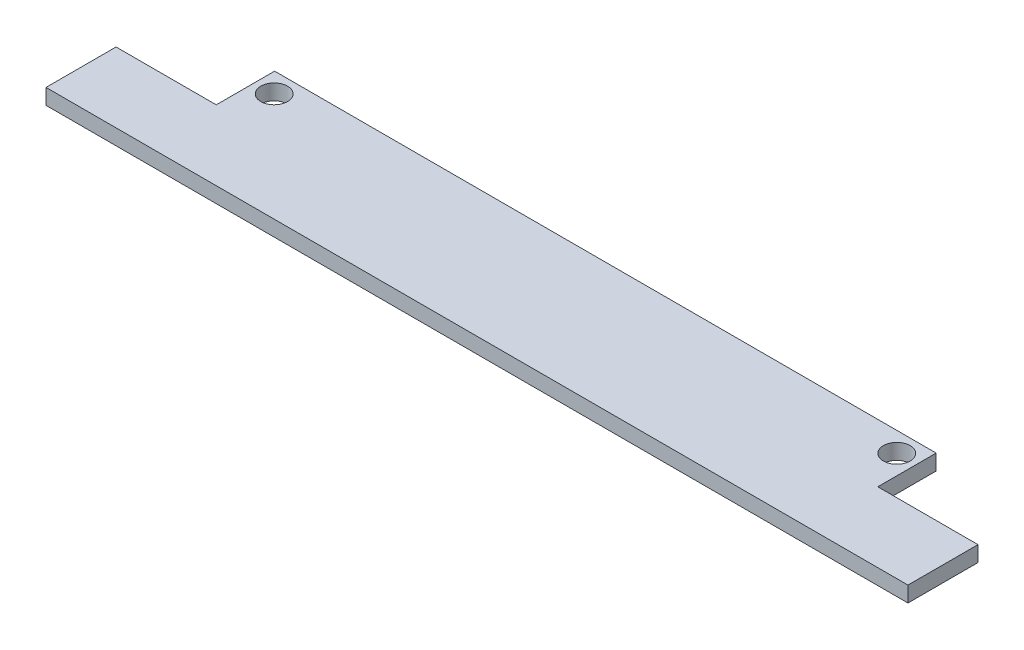
ISO-10303-21;
HEADER;
FILE_DESCRIPTION(('STEP AP214'),'2;1');
FILE_NAME('part.step','',(''),(''),'','','');
FILE_SCHEMA(('AUTOMOTIVE_DESIGN { 1 0 10303 214 1 1 1 1 }'));
ENDSEC;
DATA;
#1=APPLICATION_CONTEXT('core data for automotive mechanical design processes');
#2=APPLICATION_PROTOCOL_DEFINITION('international standard','automotive_design',2000,#1);
#3=PRODUCT_CONTEXT('',#1,'mechanical');
#4=PRODUCT('Part','Part','',(#3));
#5=PRODUCT_RELATED_PRODUCT_CATEGORY('part','',(#4));
#6=PRODUCT_DEFINITION_FORMATION('','',#4);
#7=PRODUCT_DEFINITION_CONTEXT('part definition',#1,'design');
#8=PRODUCT_DEFINITION('design','',#6,#7);
#9=PRODUCT_DEFINITION_SHAPE('','',#8);
#10=(LENGTH_UNIT() NAMED_UNIT(*) SI_UNIT(.MILLI.,.METRE.));
#11=(NAMED_UNIT(*) PLANE_ANGLE_UNIT() SI_UNIT($,.RADIAN.));
#12=(NAMED_UNIT(*) SI_UNIT($,.STERADIAN.) SOLID_ANGLE_UNIT());
#13=UNCERTAINTY_MEASURE_WITH_UNIT(LENGTH_MEASURE(1.E-05),#10,'distance_accuracy_value','');
#14=(GEOMETRIC_REPRESENTATION_CONTEXT(3) GLOBAL_UNCERTAINTY_ASSIGNED_CONTEXT((#13)) GLOBAL_UNIT_ASSIGNED_CONTEXT((#10,
#11,#12)) REPRESENTATION_CONTEXT('',''));
#15=CARTESIAN_POINT('',(0.,0.,0.));
#16=DIRECTION('',(0.,0.,1.));
#17=DIRECTION('',(1.,0.,0.));
#18=AXIS2_PLACEMENT_3D('',#15,#16,#17);
#19=CARTESIAN_POINT('',(53.6050386934042,1.6,1.03322132280104E-13));
#20=DIRECTION('',(1.,0.,0.));
#21=DIRECTION('',(0.,0.,-1.));
#22=AXIS2_PLACEMENT_3D('',#19,#20,#21);
#23=PLANE('',#22);
#24=DIRECTION('',(0.,0.,1.));
#25=VECTOR('',#24,1.);
#26=CARTESIAN_POINT('',(53.6050386934042,0.,1.03322132280104E-13));
#27=LINE('',#26,#25);
#28=CARTESIAN_POINT('',(53.6050386934042,0.,25.3150601226482));
#29=VERTEX_POINT('',#28);
#30=CARTESIAN_POINT('',(53.6050386934042,0.,32.5150601226483));
#31=VERTEX_POINT('',#30);
#32=EDGE_CURVE('E173',#29,#31,#27,.T.);
#33=ORIENTED_EDGE('',*,*,#32,.F.);
#34=DIRECTION('',(0.,-1.,0.));
#35=VECTOR('',#34,1.);
#36=CARTESIAN_POINT('',(53.6050386934042,1.6,25.3150601226482));
#37=LINE('',#36,#35);
#38=CARTESIAN_POINT('',(53.6050386934042,1.6,25.3150601226482));
#39=VERTEX_POINT('',#38);
#40=EDGE_CURVE('E11',#39,#29,#37,.T.);
#41=ORIENTED_EDGE('',*,*,#40,.F.);
#42=DIRECTION('',(0.,0.,1.));
#43=VECTOR('',#42,1.);
#44=CARTESIAN_POINT('',(53.6050386934042,1.6,1.03322132280104E-13));
#45=LINE('',#44,#43);
#46=CARTESIAN_POINT('',(53.6050386934042,1.6,32.5150601226483));
#47=VERTEX_POINT('',#46);
#48=EDGE_CURVE('E132',#39,#47,#45,.T.);
#49=ORIENTED_EDGE('',*,*,#48,.T.);
#50=DIRECTION('',(0.,-1.,0.));
#51=VECTOR('',#50,1.);
#52=CARTESIAN_POINT('',(53.6050386934042,1.6,32.5150601226483));
#53=LINE('',#52,#51);
#54=EDGE_CURVE('E85',#47,#31,#53,.T.);
#55=ORIENTED_EDGE('',*,*,#54,.T.);
#56=EDGE_LOOP('',(#33,#41,#49,#55));
#57=FACE_BOUND('',#56,.T.);
#58=ADVANCED_FACE('F35',(#57),#23,.T.);
#59=CARTESIAN_POINT('',(0.,1.6,25.3150601226483));
#60=DIRECTION('',(0.,0.,-1.));
#61=DIRECTION('',(-1.,0.,0.));
#62=AXIS2_PLACEMENT_3D('',#59,#60,#61);
#63=PLANE('',#62);
#64=DIRECTION('',(1.,0.,0.));
#65=VECTOR('',#64,1.);
#66=CARTESIAN_POINT('',(0.,0.,25.3150601226483));
#67=LINE('',#66,#65);
#68=CARTESIAN_POINT('',(43.3050386934042,0.,25.3150601226483));
#69=VERTEX_POINT('',#68);
#70=EDGE_CURVE('E167',#69,#29,#67,.T.);
#71=ORIENTED_EDGE('',*,*,#70,.F.);
#72=DIRECTION('',(0.,-1.,0.));
#73=VECTOR('',#72,1.);
#74=CARTESIAN_POINT('',(43.3050386934042,1.6,25.3150601226483));
#75=LINE('',#74,#73);
#76=CARTESIAN_POINT('',(43.3050386934042,1.6,25.3150601226483));
#77=VERTEX_POINT('',#76);
#78=EDGE_CURVE('E43',#77,#69,#75,.T.);
#79=ORIENTED_EDGE('',*,*,#78,.F.);
#80=DIRECTION('',(1.,0.,0.));
#81=VECTOR('',#80,1.);
#82=CARTESIAN_POINT('',(0.,1.6,25.3150601226483));
#83=LINE('',#82,#81);
#84=EDGE_CURVE('E125',#77,#39,#83,.T.);
#85=ORIENTED_EDGE('',*,*,#84,.T.);
#86=ORIENTED_EDGE('',*,*,#40,.T.);
#87=EDGE_LOOP('',(#71,#79,#85,#86));
#88=FACE_BOUND('',#87,.T.);
#89=ADVANCED_FACE('F172',(#88),#63,.T.);
#90=CARTESIAN_POINT('',(43.3050386934042,1.6,0.));
#91=DIRECTION('',(-1.,0.,0.));
#92=DIRECTION('',(0.,0.,1.));
#93=AXIS2_PLACEMENT_3D('',#90,#91,#92);
#94=PLANE('',#93);
#95=DIRECTION('',(0.,0.,-1.));
#96=VECTOR('',#95,1.);
#97=CARTESIAN_POINT('',(43.3050386934042,0.,0.));
#98=LINE('',#97,#96);
#99=CARTESIAN_POINT('',(43.3050386934042,0.,19.3150601226483));
#100=VERTEX_POINT('',#99);
#101=EDGE_CURVE('E159',#69,#100,#98,.T.);
#102=ORIENTED_EDGE('',*,*,#101,.T.);
#103=DIRECTION('',(0.,-1.,0.));
#104=VECTOR('',#103,1.);
#105=CARTESIAN_POINT('',(43.3050386934042,1.6,19.3150601226483));
#106=LINE('',#105,#104);
#107=CARTESIAN_POINT('',(43.3050386934042,1.6,19.3150601226483));
#108=VERTEX_POINT('',#107);
#109=EDGE_CURVE('E152',#108,#100,#106,.T.);
#110=ORIENTED_EDGE('',*,*,#109,.F.);
#111=DIRECTION('',(0.,0.,-1.));
#112=VECTOR('',#111,1.);
#113=CARTESIAN_POINT('',(43.3050386934042,1.6,0.));
#114=LINE('',#113,#112);
#115=EDGE_CURVE('E131',#77,#108,#114,.T.);
#116=ORIENTED_EDGE('',*,*,#115,.F.);
#117=ORIENTED_EDGE('',*,*,#78,.T.);
#118=EDGE_LOOP('',(#102,#110,#116,#117));
#119=FACE_BOUND('',#118,.T.);
#120=ADVANCED_FACE('F157',(#119),#94,.F.);
#121=CARTESIAN_POINT('',(0.,1.6,19.3150601226483));
#122=DIRECTION('',(0.,0.,-1.));
#123=DIRECTION('',(-1.,0.,0.));
#124=AXIS2_PLACEMENT_3D('',#121,#122,#123);
#125=PLANE('',#124);
#126=DIRECTION('',(1.,0.,0.));
#127=VECTOR('',#126,1.);
#128=CARTESIAN_POINT('',(0.,0.,19.3150601226483));
#129=LINE('',#128,#127);
#130=CARTESIAN_POINT('',(-24.6949613065958,0.,19.3150601226483));
#131=VERTEX_POINT('',#130);
#132=EDGE_CURVE('E170',#131,#100,#129,.T.);
#133=ORIENTED_EDGE('',*,*,#132,.F.);
#134=DIRECTION('',(0.,-1.,0.));
#135=VECTOR('',#134,1.);
#136=CARTESIAN_POINT('',(-24.6949613065958,1.6,19.3150601226483));
#137=LINE('',#136,#135);
#138=CARTESIAN_POINT('',(-24.6949613065958,1.6,19.3150601226483));
#139=VERTEX_POINT('',#138);
#140=EDGE_CURVE('E150',#139,#131,#137,.T.);
#141=ORIENTED_EDGE('',*,*,#140,.F.);
#142=DIRECTION('',(1.,0.,0.));
#143=VECTOR('',#142,1.);
#144=CARTESIAN_POINT('',(0.,1.6,19.3150601226483));
#145=LINE('',#144,#143);
#146=EDGE_CURVE('E126',#139,#108,#145,.T.);
#147=ORIENTED_EDGE('',*,*,#146,.T.);
#148=ORIENTED_EDGE('',*,*,#109,.T.);
#149=EDGE_LOOP('',(#133,#141,#147,#148));
#150=FACE_BOUND('',#149,.T.);
#151=ADVANCED_FACE('F192',(#150),#125,.T.);
#152=CARTESIAN_POINT('',(-24.6949613065958,1.6,0.));
#153=DIRECTION('',(-1.,0.,0.));
#154=DIRECTION('',(0.,0.,1.));
#155=AXIS2_PLACEMENT_3D('',#152,#153,#154);
#156=PLANE('',#155);
#157=DIRECTION('',(0.,0.,-1.));
#158=VECTOR('',#157,1.);
#159=CARTESIAN_POINT('',(-24.6949613065958,0.,0.));
#160=LINE('',#159,#158);
#161=CARTESIAN_POINT('',(-24.6949613065958,0.,25.3150601226483));
#162=VERTEX_POINT('',#161);
#163=EDGE_CURVE('E176',#162,#131,#160,.T.);
#164=ORIENTED_EDGE('',*,*,#163,.F.);
#165=DIRECTION('',(0.,-1.,0.));
#166=VECTOR('',#165,1.);
#167=CARTESIAN_POINT('',(-24.6949613065958,1.6,25.3150601226483));
#168=LINE('',#167,#166);
#169=CARTESIAN_POINT('',(-24.6949613065958,1.6,25.3150601226483));
#170=VERTEX_POINT('',#169);
#171=EDGE_CURVE('E112',#170,#162,#168,.T.);
#172=ORIENTED_EDGE('',*,*,#171,.F.);
#173=DIRECTION('',(0.,0.,-1.));
#174=VECTOR('',#173,1.);
#175=CARTESIAN_POINT('',(-24.6949613065958,1.6,0.));
#176=LINE('',#175,#174);
#177=EDGE_CURVE('E123',#170,#139,#176,.T.);
#178=ORIENTED_EDGE('',*,*,#177,.T.);
#179=ORIENTED_EDGE('',*,*,#140,.T.);
#180=EDGE_LOOP('',(#164,#172,#178,#179));
#181=FACE_BOUND('',#180,.T.);
#182=ADVANCED_FACE('F196',(#181),#156,.T.);
#183=CARTESIAN_POINT('',(-34.9949613065958,0.,25.3150601226483));
#184=VERTEX_POINT('',#183);
#185=EDGE_CURVE('E111',#184,#162,#67,.T.);
#186=ORIENTED_EDGE('',*,*,#185,.F.);
#187=DIRECTION('',(0.,-1.,0.));
#188=VECTOR('',#187,1.);
#189=CARTESIAN_POINT('',(-34.9949613065958,1.6,25.3150601226483));
#190=LINE('',#189,#188);
#191=CARTESIAN_POINT('',(-34.9949613065958,1.6,25.3150601226483));
#192=VERTEX_POINT('',#191);
#193=EDGE_CURVE('E105',#192,#184,#190,.T.);
#194=ORIENTED_EDGE('',*,*,#193,.F.);
#195=EDGE_CURVE('E109',#192,#170,#83,.T.);
#196=ORIENTED_EDGE('',*,*,#195,.T.);
#197=ORIENTED_EDGE('',*,*,#171,.T.);
#198=EDGE_LOOP('',(#186,#194,#196,#197));
#199=FACE_BOUND('',#198,.T.);
#200=ADVANCED_FACE('F107',(#199),#63,.T.);
#201=CARTESIAN_POINT('',(-34.9949613065959,1.6,0.));
#202=DIRECTION('',(1.,0.,0.));
#203=DIRECTION('',(0.,0.,-1.));
#204=AXIS2_PLACEMENT_3D('',#201,#202,#203);
#205=PLANE('',#204);
#206=DIRECTION('',(0.,0.,1.));
#207=VECTOR('',#206,1.);
#208=CARTESIAN_POINT('',(-34.9949613065959,0.,0.));
#209=LINE('',#208,#207);
#210=CARTESIAN_POINT('',(-34.9949613065958,0.,32.5150601226483));
#211=VERTEX_POINT('',#210);
#212=EDGE_CURVE('E78',#184,#211,#209,.T.);
#213=ORIENTED_EDGE('',*,*,#212,.T.);
#214=DIRECTION('',(0.,-1.,0.));
#215=VECTOR('',#214,1.);
#216=CARTESIAN_POINT('',(-34.9949613065958,1.6,32.5150601226483));
#217=LINE('',#216,#215);
#218=CARTESIAN_POINT('',(-34.9949613065958,1.6,32.5150601226483));
#219=VERTEX_POINT('',#218);
#220=EDGE_CURVE('E113',#219,#211,#217,.T.);
#221=ORIENTED_EDGE('',*,*,#220,.F.);
#222=DIRECTION('',(0.,0.,1.));
#223=VECTOR('',#222,1.);
#224=CARTESIAN_POINT('',(-34.9949613065959,1.6,0.));
#225=LINE('',#224,#223);
#226=EDGE_CURVE('E115',#192,#219,#225,.T.);
#227=ORIENTED_EDGE('',*,*,#226,.F.);
#228=ORIENTED_EDGE('',*,*,#193,.T.);
#229=EDGE_LOOP('',(#213,#221,#227,#228));
#230=FACE_BOUND('',#229,.T.);
#231=ADVANCED_FACE('F116',(#230),#205,.F.);
#232=CARTESIAN_POINT('',(-22.6949613065958,1.6,21.3622913657332));
#233=DIRECTION('',(0.,-1.,0.));
#234=DIRECTION('',(0.,0.,-1.));
#235=AXIS2_PLACEMENT_3D('',#232,#233,#234);
#236=CYLINDRICAL_SURFACE('',#235,1.375);
#237=CARTESIAN_POINT('',(-22.6949613065958,1.6,21.3622913657332));
#238=DIRECTION('',(0.,1.,0.));
#239=DIRECTION('',(0.,0.,1.));
#240=AXIS2_PLACEMENT_3D('',#237,#238,#239);
#241=CIRCLE('',#240,1.375);
#242=CARTESIAN_POINT('',(-22.6949613065958,1.6,22.7372913657332));
#243=VERTEX_POINT('',#242);
#244=EDGE_CURVE('E212',#243,#243,#241,.T.);
#245=ORIENTED_EDGE('',*,*,#244,.T.);
#246=EDGE_LOOP('',(#245));
#247=FACE_BOUND('',#246,.T.);
#248=CARTESIAN_POINT('',(-22.6949613065958,0.,21.3622913657332));
#249=DIRECTION('',(0.,1.,0.));
#250=DIRECTION('',(0.,0.,1.));
#251=AXIS2_PLACEMENT_3D('',#248,#249,#250);
#252=CIRCLE('',#251,1.375);
#253=CARTESIAN_POINT('',(-22.6949613065958,0.,22.7372913657332));
#254=VERTEX_POINT('',#253);
#255=EDGE_CURVE('E137',#254,#254,#252,.T.);
#256=ORIENTED_EDGE('',*,*,#255,.F.);
#257=EDGE_LOOP('',(#256));
#258=FACE_BOUND('',#257,.T.);
#259=ADVANCED_FACE('F201',(#247,#258),#236,.F.);
#260=CARTESIAN_POINT('',(0.,1.6,32.5150601226483));
#261=DIRECTION('',(0.,0.,-1.));
#262=DIRECTION('',(-1.,0.,0.));
#263=AXIS2_PLACEMENT_3D('',#260,#261,#262);
#264=PLANE('',#263);
#265=DIRECTION('',(1.,0.,0.));
#266=VECTOR('',#265,1.);
#267=CARTESIAN_POINT('',(0.,0.,32.5150601226483));
#268=LINE('',#267,#266);
#269=EDGE_CURVE('E142',#211,#31,#268,.T.);
#270=ORIENTED_EDGE('',*,*,#269,.T.);
#271=ORIENTED_EDGE('',*,*,#54,.F.);
#272=DIRECTION('',(1.,0.,0.));
#273=VECTOR('',#272,1.);
#274=CARTESIAN_POINT('',(0.,1.6,32.5150601226483));
#275=LINE('',#274,#273);
#276=EDGE_CURVE('E51',#219,#47,#275,.T.);
#277=ORIENTED_EDGE('',*,*,#276,.F.);
#278=ORIENTED_EDGE('',*,*,#220,.T.);
#279=EDGE_LOOP('',(#270,#271,#277,#278));
#280=FACE_BOUND('',#279,.T.);
#281=ADVANCED_FACE('F183',(#280),#264,.F.);
#282=CARTESIAN_POINT('',(41.3050386934042,1.6,21.3622913657332));
#283=DIRECTION('',(0.,-1.,0.));
#284=DIRECTION('',(0.,0.,-1.));
#285=AXIS2_PLACEMENT_3D('',#282,#283,#284);
#286=CYLINDRICAL_SURFACE('',#285,1.375);
#287=CARTESIAN_POINT('',(41.3050386934042,1.6,21.3622913657332));
#288=DIRECTION('',(0.,1.,0.));
#289=DIRECTION('',(0.,0.,1.));
#290=AXIS2_PLACEMENT_3D('',#287,#288,#289);
#291=CIRCLE('',#290,1.375);
#292=CARTESIAN_POINT('',(41.3050386934042,1.6,22.7372913657332));
#293=VERTEX_POINT('',#292);
#294=EDGE_CURVE('E147',#293,#293,#291,.F.);
#295=ORIENTED_EDGE('',*,*,#294,.F.);
#296=EDGE_LOOP('',(#295));
#297=FACE_BOUND('',#296,.T.);
#298=CARTESIAN_POINT('',(41.3050386934042,0.,21.3622913657332));
#299=DIRECTION('',(0.,1.,0.));
#300=DIRECTION('',(0.,0.,1.));
#301=AXIS2_PLACEMENT_3D('',#298,#299,#300);
#302=CIRCLE('',#301,1.375);
#303=CARTESIAN_POINT('',(41.3050386934042,0.,22.7372913657332));
#304=VERTEX_POINT('',#303);
#305=EDGE_CURVE('E135',#304,#304,#302,.F.);
#306=ORIENTED_EDGE('',*,*,#305,.T.);
#307=EDGE_LOOP('',(#306));
#308=FACE_BOUND('',#307,.T.);
#309=ADVANCED_FACE('F219',(#297,#308),#286,.F.);
#310=CARTESIAN_POINT('',(0.,1.6,0.));
#311=DIRECTION('',(0.,1.,0.));
#312=DIRECTION('',(0.,0.,1.));
#313=AXIS2_PLACEMENT_3D('',#310,#311,#312);
#314=PLANE('',#313);
#315=ORIENTED_EDGE('',*,*,#48,.F.);
#316=ORIENTED_EDGE('',*,*,#84,.F.);
#317=ORIENTED_EDGE('',*,*,#115,.T.);
#318=ORIENTED_EDGE('',*,*,#146,.F.);
#319=ORIENTED_EDGE('',*,*,#177,.F.);
#320=ORIENTED_EDGE('',*,*,#195,.F.);
#321=ORIENTED_EDGE('',*,*,#226,.T.);
#322=ORIENTED_EDGE('',*,*,#276,.T.);
#323=EDGE_LOOP('',(#315,#316,#317,#318,#319,#320,#321,#322));
#324=FACE_BOUND('',#323,.T.);
#325=ORIENTED_EDGE('',*,*,#244,.F.);
#326=EDGE_LOOP('',(#325));
#327=FACE_BOUND('',#326,.T.);
#328=ORIENTED_EDGE('',*,*,#294,.T.);
#329=EDGE_LOOP('',(#328));
#330=FACE_BOUND('',#329,.T.);
#331=ADVANCED_FACE('F119',(#324,#327,#330),#314,.T.);
#332=CARTESIAN_POINT('',(0.,0.,0.));
#333=DIRECTION('',(0.,1.,0.));
#334=DIRECTION('',(0.,0.,1.));
#335=AXIS2_PLACEMENT_3D('',#332,#333,#334);
#336=PLANE('',#335);
#337=ORIENTED_EDGE('',*,*,#32,.T.);
#338=ORIENTED_EDGE('',*,*,#269,.F.);
#339=ORIENTED_EDGE('',*,*,#212,.F.);
#340=ORIENTED_EDGE('',*,*,#185,.T.);
#341=ORIENTED_EDGE('',*,*,#163,.T.);
#342=ORIENTED_EDGE('',*,*,#132,.T.);
#343=ORIENTED_EDGE('',*,*,#101,.F.);
#344=ORIENTED_EDGE('',*,*,#70,.T.);
#345=EDGE_LOOP('',(#337,#338,#339,#340,#341,#342,#343,#344));
#346=FACE_BOUND('',#345,.T.);
#347=ORIENTED_EDGE('',*,*,#255,.T.);
#348=EDGE_LOOP('',(#347));
#349=FACE_BOUND('',#348,.T.);
#350=ORIENTED_EDGE('',*,*,#305,.F.);
#351=EDGE_LOOP('',(#350));
#352=FACE_BOUND('',#351,.T.);
#353=ADVANCED_FACE('F165',(#346,#349,#352),#336,.F.);
#354=CLOSED_SHELL('',(#58,#89,#120,#151,#182,#200,#231,#259,#281,#309,#331,#353));
#355=MANIFOLD_SOLID_BREP('B2',#354);
#356=ADVANCED_BREP_SHAPE_REPRESENTATION('',(#18,#355),#14);
#357=SHAPE_DEFINITION_REPRESENTATION(#9,#356);
ENDSEC;
END-ISO-10303-21;
